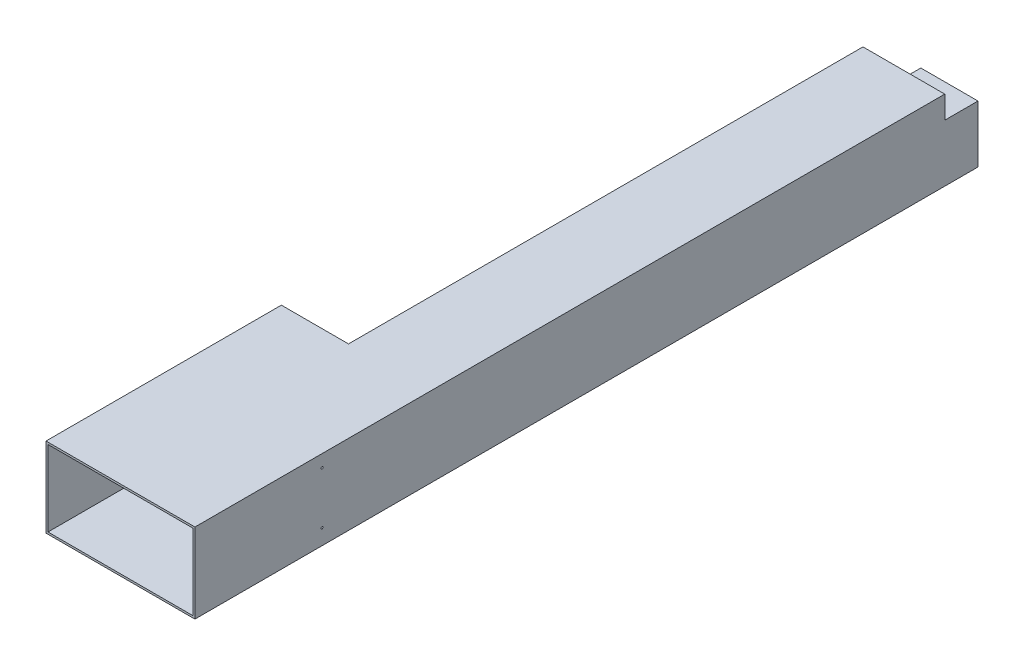
ISO-10303-21;
HEADER;
FILE_DESCRIPTION(('STEP AP214'),'2;1');
FILE_NAME('part.step','',(''),(''),'','','');
FILE_SCHEMA(('AUTOMOTIVE_DESIGN { 1 0 10303 214 1 1 1 1 }'));
ENDSEC;
DATA;
#1=APPLICATION_CONTEXT('core data for automotive mechanical design processes');
#2=APPLICATION_PROTOCOL_DEFINITION('international standard','automotive_design',2000,#1);
#3=PRODUCT_CONTEXT('',#1,'mechanical');
#4=PRODUCT('Part','Part','',(#3));
#5=PRODUCT_RELATED_PRODUCT_CATEGORY('part','',(#4));
#6=PRODUCT_DEFINITION_FORMATION('','',#4);
#7=PRODUCT_DEFINITION_CONTEXT('part definition',#1,'design');
#8=PRODUCT_DEFINITION('design','',#6,#7);
#9=PRODUCT_DEFINITION_SHAPE('','',#8);
#10=(LENGTH_UNIT() NAMED_UNIT(*) SI_UNIT(.MILLI.,.METRE.));
#11=(NAMED_UNIT(*) PLANE_ANGLE_UNIT() SI_UNIT($,.RADIAN.));
#12=(NAMED_UNIT(*) SI_UNIT($,.STERADIAN.) SOLID_ANGLE_UNIT());
#13=UNCERTAINTY_MEASURE_WITH_UNIT(LENGTH_MEASURE(1.E-05),#10,'distance_accuracy_value','');
#14=(GEOMETRIC_REPRESENTATION_CONTEXT(3) GLOBAL_UNCERTAINTY_ASSIGNED_CONTEXT((#13)) GLOBAL_UNIT_ASSIGNED_CONTEXT((#10,
#11,#12)) REPRESENTATION_CONTEXT('',''));
#15=CARTESIAN_POINT('',(0.,0.,0.));
#16=DIRECTION('',(0.,0.,1.));
#17=DIRECTION('',(1.,0.,0.));
#18=AXIS2_PLACEMENT_3D('',#15,#16,#17);
#19=CARTESIAN_POINT('',(0.,5700.,-30555.9041394149));
#20=DIRECTION('',(-1.,0.,0.));
#21=DIRECTION('',(0.,0.,1.));
#22=AXIS2_PLACEMENT_3D('',#19,#20,#21);
#23=PLANE('',#22);
#24=DIRECTION('',(0.,-1.,0.));
#25=VECTOR('',#24,1.);
#26=CARTESIAN_POINT('',(0.,5700.00000000001,-17550.));
#27=LINE('',#26,#25);
#28=CARTESIAN_POINT('',(0.,5700.00000000001,-17550.));
#29=VERTEX_POINT('',#28);
#30=CARTESIAN_POINT('',(0.,7.105427357601E-12,-17550.));
#31=VERTEX_POINT('',#30);
#32=EDGE_CURVE('E11',#29,#31,#27,.T.);
#33=ORIENTED_EDGE('',*,*,#32,.F.);
#34=DIRECTION('',(0.,0.,1.));
#35=VECTOR('',#34,1.);
#36=CARTESIAN_POINT('',(0.,5700.,-30555.9041394149));
#37=LINE('',#36,#35);
#38=CARTESIAN_POINT('',(0.,5700.,0.));
#39=VERTEX_POINT('',#38);
#40=EDGE_CURVE('E181',#29,#39,#37,.T.);
#41=ORIENTED_EDGE('',*,*,#40,.T.);
#42=DIRECTION('',(0.,-1.,0.));
#43=VECTOR('',#42,1.);
#44=CARTESIAN_POINT('',(0.,5700.,0.));
#45=LINE('',#44,#43);
#46=CARTESIAN_POINT('',(0.,0.,0.));
#47=VERTEX_POINT('',#46);
#48=EDGE_CURVE('E278',#39,#47,#45,.T.);
#49=ORIENTED_EDGE('',*,*,#48,.T.);
#50=DIRECTION('',(0.,0.,1.));
#51=VECTOR('',#50,1.);
#52=CARTESIAN_POINT('',(0.,0.,-30555.9041394149));
#53=LINE('',#52,#51);
#54=EDGE_CURVE('E282',#31,#47,#53,.T.);
#55=ORIENTED_EDGE('',*,*,#54,.F.);
#56=EDGE_LOOP('',(#33,#41,#49,#55));
#57=FACE_BOUND('',#56,.T.);
#58=ADVANCED_FACE('F30',(#57),#23,.F.);
#59=CARTESIAN_POINT('',(0.,5700.00000000001,-17700.));
#60=DIRECTION('',(0.,0.,-1.));
#61=DIRECTION('',(-1.,0.,0.));
#62=AXIS2_PLACEMENT_3D('',#59,#60,#61);
#63=PLANE('',#62);
#64=DIRECTION('',(-1.,0.,0.));
#65=VECTOR('',#64,1.);
#66=CARTESIAN_POINT('',(11050.,5850.,-17700.));
#67=LINE('',#66,#65);
#68=CARTESIAN_POINT('',(4900.,5850.,-17700.));
#69=VERTEX_POINT('',#68);
#70=CARTESIAN_POINT('',(-150.000000000002,5850.,-17700.));
#71=VERTEX_POINT('',#70);
#72=EDGE_CURVE('E241',#69,#71,#67,.T.);
#73=ORIENTED_EDGE('',*,*,#72,.F.);
#74=DIRECTION('',(0.,-1.,0.));
#75=VECTOR('',#74,1.);
#76=CARTESIAN_POINT('',(4900.,-150.000000000002,-17700.));
#77=LINE('',#76,#75);
#78=CARTESIAN_POINT('',(4900.,-150.000000000002,-17700.));
#79=VERTEX_POINT('',#78);
#80=EDGE_CURVE('E38',#69,#79,#77,.T.);
#81=ORIENTED_EDGE('',*,*,#80,.T.);
#82=DIRECTION('',(1.,0.,0.));
#83=VECTOR('',#82,1.);
#84=CARTESIAN_POINT('',(-149.999999999999,-149.999999999995,-17700.));
#85=LINE('',#84,#83);
#86=CARTESIAN_POINT('',(-149.999999999999,-149.999999999995,-17700.));
#87=VERTEX_POINT('',#86);
#88=EDGE_CURVE('E297',#87,#79,#85,.T.);
#89=ORIENTED_EDGE('',*,*,#88,.F.);
#90=DIRECTION('',(0.,-1.,0.));
#91=VECTOR('',#90,1.);
#92=CARTESIAN_POINT('',(-150.000000000002,5850.,-17700.));
#93=LINE('',#92,#91);
#94=EDGE_CURVE('E295',#71,#87,#93,.T.);
#95=ORIENTED_EDGE('',*,*,#94,.F.);
#96=EDGE_LOOP('',(#73,#81,#89,#95));
#97=FACE_BOUND('',#96,.T.);
#98=ADVANCED_FACE('F32',(#97),#63,.T.);
#99=CARTESIAN_POINT('',(11050.,-149.999999999999,-30555.9041394149));
#100=DIRECTION('',(1.,0.,0.));
#101=DIRECTION('',(0.,0.,-1.));
#102=AXIS2_PLACEMENT_3D('',#99,#100,#101);
#103=PLANE('',#102);
#104=CARTESIAN_POINT('',(11050.,1020.,-9560.));
#105=DIRECTION('',(1.,0.,0.));
#106=DIRECTION('',(0.,0.,-1.));
#107=AXIS2_PLACEMENT_3D('',#104,#105,#106);
#108=CIRCLE('',#107,74.9999999999987);
#109=CARTESIAN_POINT('',(11050.,1020.,-9635.));
#110=VERTEX_POINT('',#109);
#111=EDGE_CURVE('E436',#110,#110,#108,.T.);
#112=ORIENTED_EDGE('',*,*,#111,.F.);
#113=EDGE_LOOP('',(#112));
#114=FACE_BOUND('',#113,.T.);
#115=CARTESIAN_POINT('',(11050.,4920.,-9560.));
#116=DIRECTION('',(1.,0.,0.));
#117=DIRECTION('',(0.,0.,-1.));
#118=AXIS2_PLACEMENT_3D('',#115,#116,#117);
#119=CIRCLE('',#118,74.9999999999987);
#120=CARTESIAN_POINT('',(11050.,4920.,-9635.));
#121=VERTEX_POINT('',#120);
#122=EDGE_CURVE('E444',#121,#121,#119,.T.);
#123=ORIENTED_EDGE('',*,*,#122,.F.);
#124=EDGE_LOOP('',(#123));
#125=FACE_BOUND('',#124,.T.);
#126=DIRECTION('',(0.,0.,1.));
#127=VECTOR('',#126,1.);
#128=CARTESIAN_POINT('',(11050.,-149.999999999999,-30555.9041394149));
#129=LINE('',#128,#127);
#130=CARTESIAN_POINT('',(11050.,-149.999999999995,-58890.));
#131=VERTEX_POINT('',#130);
#132=CARTESIAN_POINT('',(11050.,-149.999999999999,0.));
#133=VERTEX_POINT('',#132);
#134=EDGE_CURVE('E300',#131,#133,#129,.T.);
#135=ORIENTED_EDGE('',*,*,#134,.F.);
#136=DIRECTION('',(0.,-1.,0.));
#137=VECTOR('',#136,1.);
#138=CARTESIAN_POINT('',(11050.,4150.00000000001,-58890.));
#139=LINE('',#138,#137);
#140=CARTESIAN_POINT('',(11050.,4150.00000000001,-58890.));
#141=VERTEX_POINT('',#140);
#142=EDGE_CURVE('E203',#141,#131,#139,.T.);
#143=ORIENTED_EDGE('',*,*,#142,.F.);
#144=DIRECTION('',(0.,0.,-1.));
#145=VECTOR('',#144,1.);
#146=CARTESIAN_POINT('',(11050.,4150.,-50158.8816817957));
#147=LINE('',#146,#145);
#148=CARTESIAN_POINT('',(11050.,4150.,-56390.));
#149=VERTEX_POINT('',#148);
#150=EDGE_CURVE('E231',#149,#141,#147,.T.);
#151=ORIENTED_EDGE('',*,*,#150,.F.);
#152=DIRECTION('',(0.,-1.,0.));
#153=VECTOR('',#152,1.);
#154=CARTESIAN_POINT('',(11050.,5850.,-56390.));
#155=LINE('',#154,#153);
#156=CARTESIAN_POINT('',(11050.,5850.,-56390.));
#157=VERTEX_POINT('',#156);
#158=EDGE_CURVE('E185',#157,#149,#155,.T.);
#159=ORIENTED_EDGE('',*,*,#158,.F.);
#160=DIRECTION('',(0.,0.,1.));
#161=VECTOR('',#160,1.);
#162=CARTESIAN_POINT('',(11050.,5850.,-30555.9041394149));
#163=LINE('',#162,#161);
#164=CARTESIAN_POINT('',(11050.,5850.,0.));
#165=VERTEX_POINT('',#164);
#166=EDGE_CURVE('E254',#157,#165,#163,.T.);
#167=ORIENTED_EDGE('',*,*,#166,.T.);
#168=DIRECTION('',(0.,1.,0.));
#169=VECTOR('',#168,1.);
#170=CARTESIAN_POINT('',(11050.,-149.999999999999,0.));
#171=LINE('',#170,#169);
#172=EDGE_CURVE('E275',#133,#165,#171,.T.);
#173=ORIENTED_EDGE('',*,*,#172,.F.);
#174=EDGE_LOOP('',(#135,#143,#151,#159,#167,#173));
#175=FACE_BOUND('',#174,.T.);
#176=ADVANCED_FACE('F347',(#114,#125,#175),#103,.T.);
#177=CARTESIAN_POINT('',(-149.999999999999,-149.999999999999,-30555.9041394149));
#178=DIRECTION('',(0.,-1.,0.));
#179=DIRECTION('',(0.,0.,-1.));
#180=AXIS2_PLACEMENT_3D('',#177,#178,#179);
#181=PLANE('',#180);
#182=CARTESIAN_POINT('',(8050.,-149.999999999999,-22960.));
#183=DIRECTION('',(0.,-1.,0.));
#184=DIRECTION('',(0.,0.,-1.));
#185=AXIS2_PLACEMENT_3D('',#182,#183,#184);
#186=CIRCLE('',#185,50.0000000000005);
#187=CARTESIAN_POINT('',(8050.,-149.999999999999,-23010.));
#188=VERTEX_POINT('',#187);
#189=EDGE_CURVE('E431',#188,#188,#186,.T.);
#190=ORIENTED_EDGE('',*,*,#189,.F.);
#191=EDGE_LOOP('',(#190));
#192=FACE_BOUND('',#191,.T.);
#193=DIRECTION('',(1.,0.,0.));
#194=VECTOR('',#193,1.);
#195=CARTESIAN_POINT('',(-149.999999999999,-149.999999999999,0.));
#196=LINE('',#195,#194);
#197=CARTESIAN_POINT('',(-149.999999999999,-149.999999999999,0.));
#198=VERTEX_POINT('',#197);
#199=EDGE_CURVE('E240',#198,#133,#196,.T.);
#200=ORIENTED_EDGE('',*,*,#199,.F.);
#201=DIRECTION('',(0.,0.,1.));
#202=VECTOR('',#201,1.);
#203=CARTESIAN_POINT('',(-149.999999999999,-149.999999999999,-30555.9041394149));
#204=LINE('',#203,#202);
#205=EDGE_CURVE('E308',#87,#198,#204,.T.);
#206=ORIENTED_EDGE('',*,*,#205,.F.);
#207=ORIENTED_EDGE('',*,*,#88,.T.);
#208=DIRECTION('',(0.,0.,-1.));
#209=VECTOR('',#208,1.);
#210=CARTESIAN_POINT('',(4900.,-150.000000000002,-9107.99790502819));
#211=LINE('',#210,#209);
#212=CARTESIAN_POINT('',(4900.,-150.000000000002,-56390.));
#213=VERTEX_POINT('',#212);
#214=EDGE_CURVE('E166',#79,#213,#211,.T.);
#215=ORIENTED_EDGE('',*,*,#214,.T.);
#216=DIRECTION('',(-1.,0.,0.));
#217=VECTOR('',#216,1.);
#218=CARTESIAN_POINT('',(6750.,-150.000000000002,-56390.));
#219=LINE('',#218,#217);
#220=CARTESIAN_POINT('',(6750.,-150.000000000002,-56390.));
#221=VERTEX_POINT('',#220);
#222=EDGE_CURVE('E194',#221,#213,#219,.T.);
#223=ORIENTED_EDGE('',*,*,#222,.F.);
#224=DIRECTION('',(0.,0.,-1.));
#225=VECTOR('',#224,1.);
#226=CARTESIAN_POINT('',(6750.,-149.999999999995,-50158.8816817957));
#227=LINE('',#226,#225);
#228=CARTESIAN_POINT('',(6750.,-149.999999999995,-58890.));
#229=VERTEX_POINT('',#228);
#230=EDGE_CURVE('E45',#221,#229,#227,.T.);
#231=ORIENTED_EDGE('',*,*,#230,.T.);
#232=DIRECTION('',(-1.,0.,0.));
#233=VECTOR('',#232,1.);
#234=CARTESIAN_POINT('',(11050.,-149.999999999995,-58890.));
#235=LINE('',#234,#233);
#236=EDGE_CURVE('E206',#131,#229,#235,.T.);
#237=ORIENTED_EDGE('',*,*,#236,.F.);
#238=ORIENTED_EDGE('',*,*,#134,.T.);
#239=EDGE_LOOP('',(#200,#206,#207,#215,#223,#231,#237,#238));
#240=FACE_BOUND('',#239,.T.);
#241=ADVANCED_FACE('F322',(#192,#240),#181,.T.);
#242=CARTESIAN_POINT('',(-150.000000000002,5850.,-30555.9041394149));
#243=DIRECTION('',(-1.,0.,0.));
#244=DIRECTION('',(0.,0.,1.));
#245=AXIS2_PLACEMENT_3D('',#242,#243,#244);
#246=PLANE('',#245);
#247=ORIENTED_EDGE('',*,*,#205,.T.);
#248=DIRECTION('',(0.,-1.,0.));
#249=VECTOR('',#248,1.);
#250=CARTESIAN_POINT('',(-150.000000000002,5850.,0.));
#251=LINE('',#250,#249);
#252=CARTESIAN_POINT('',(-150.000000000002,5850.,0.));
#253=VERTEX_POINT('',#252);
#254=EDGE_CURVE('E269',#253,#198,#251,.T.);
#255=ORIENTED_EDGE('',*,*,#254,.F.);
#256=DIRECTION('',(0.,0.,1.));
#257=VECTOR('',#256,1.);
#258=CARTESIAN_POINT('',(-150.000000000002,5850.,-30555.9041394149));
#259=LINE('',#258,#257);
#260=EDGE_CURVE('E305',#71,#253,#259,.T.);
#261=ORIENTED_EDGE('',*,*,#260,.F.);
#262=ORIENTED_EDGE('',*,*,#94,.T.);
#263=EDGE_LOOP('',(#247,#255,#261,#262));
#264=FACE_BOUND('',#263,.T.);
#265=ADVANCED_FACE('F317',(#264),#246,.T.);
#266=CARTESIAN_POINT('',(11050.,5850.,-30555.9041394149));
#267=DIRECTION('',(0.,1.,0.));
#268=DIRECTION('',(0.,0.,1.));
#269=AXIS2_PLACEMENT_3D('',#266,#267,#268);
#270=PLANE('',#269);
#271=ORIENTED_EDGE('',*,*,#260,.T.);
#272=DIRECTION('',(-1.,0.,0.));
#273=VECTOR('',#272,1.);
#274=CARTESIAN_POINT('',(11050.,5850.,0.));
#275=LINE('',#274,#273);
#276=EDGE_CURVE('E272',#165,#253,#275,.T.);
#277=ORIENTED_EDGE('',*,*,#276,.F.);
#278=ORIENTED_EDGE('',*,*,#166,.F.);
#279=DIRECTION('',(1.,0.,0.));
#280=VECTOR('',#279,1.);
#281=CARTESIAN_POINT('',(4900.,5850.,-56390.));
#282=LINE('',#281,#280);
#283=CARTESIAN_POINT('',(4900.,5850.,-56390.));
#284=VERTEX_POINT('',#283);
#285=EDGE_CURVE('E182',#284,#157,#282,.T.);
#286=ORIENTED_EDGE('',*,*,#285,.F.);
#287=DIRECTION('',(0.,0.,-1.));
#288=VECTOR('',#287,1.);
#289=CARTESIAN_POINT('',(4900.,5850.,-9107.99790502819));
#290=LINE('',#289,#288);
#291=EDGE_CURVE('E245',#69,#284,#290,.T.);
#292=ORIENTED_EDGE('',*,*,#291,.F.);
#293=ORIENTED_EDGE('',*,*,#72,.T.);
#294=EDGE_LOOP('',(#271,#277,#278,#286,#292,#293));
#295=FACE_BOUND('',#294,.T.);
#296=ADVANCED_FACE('F327',(#295),#270,.T.);
#297=CARTESIAN_POINT('',(10900.,5700.,-30555.9041394149));
#298=DIRECTION('',(0.,1.,0.));
#299=DIRECTION('',(-1.,0.,0.));
#300=AXIS2_PLACEMENT_3D('',#297,#298,#299);
#301=PLANE('',#300);
#302=DIRECTION('',(-1.,0.,0.));
#303=VECTOR('',#302,1.);
#304=CARTESIAN_POINT('',(10900.,5700.,-17550.));
#305=LINE('',#304,#303);
#306=CARTESIAN_POINT('',(5050.,5700.,-17550.));
#307=VERTEX_POINT('',#306);
#308=EDGE_CURVE('E172',#307,#29,#305,.T.);
#309=ORIENTED_EDGE('',*,*,#308,.F.);
#310=DIRECTION('',(0.,0.,-1.));
#311=VECTOR('',#310,1.);
#312=CARTESIAN_POINT('',(5050.,5700.,-9107.99790502819));
#313=LINE('',#312,#311);
#314=CARTESIAN_POINT('',(5050.,5700.,-56240.));
#315=VERTEX_POINT('',#314);
#316=EDGE_CURVE('E156',#307,#315,#313,.T.);
#317=ORIENTED_EDGE('',*,*,#316,.T.);
#318=DIRECTION('',(1.,0.,0.));
#319=VECTOR('',#318,1.);
#320=CARTESIAN_POINT('',(5050.,5700.,-56240.));
#321=LINE('',#320,#319);
#322=CARTESIAN_POINT('',(10900.,5700.,-56240.));
#323=VERTEX_POINT('',#322);
#324=EDGE_CURVE('E234',#315,#323,#321,.T.);
#325=ORIENTED_EDGE('',*,*,#324,.T.);
#326=DIRECTION('',(0.,0.,1.));
#327=VECTOR('',#326,1.);
#328=CARTESIAN_POINT('',(10900.,5700.,-30555.9041394149));
#329=LINE('',#328,#327);
#330=CARTESIAN_POINT('',(10900.,5700.,0.));
#331=VERTEX_POINT('',#330);
#332=EDGE_CURVE('E290',#323,#331,#329,.T.);
#333=ORIENTED_EDGE('',*,*,#332,.T.);
#334=DIRECTION('',(-1.,0.,0.));
#335=VECTOR('',#334,1.);
#336=CARTESIAN_POINT('',(10900.,5700.,0.));
#337=LINE('',#336,#335);
#338=EDGE_CURVE('E289',#331,#39,#337,.T.);
#339=ORIENTED_EDGE('',*,*,#338,.T.);
#340=ORIENTED_EDGE('',*,*,#40,.F.);
#341=EDGE_LOOP('',(#309,#317,#325,#333,#339,#340));
#342=FACE_BOUND('',#341,.T.);
#343=ADVANCED_FACE('F179',(#342),#301,.F.);
#344=CARTESIAN_POINT('',(10900.,0.,-30555.9041394149));
#345=DIRECTION('',(1.,0.,0.));
#346=DIRECTION('',(0.,0.,-1.));
#347=AXIS2_PLACEMENT_3D('',#344,#345,#346);
#348=PLANE('',#347);
#349=CARTESIAN_POINT('',(10900.,1020.,-9560.));
#350=DIRECTION('',(1.,0.,0.));
#351=DIRECTION('',(0.,0.,-1.));
#352=AXIS2_PLACEMENT_3D('',#349,#350,#351);
#353=CIRCLE('',#352,74.9999999999987);
#354=CARTESIAN_POINT('',(10900.,1020.,-9635.));
#355=VERTEX_POINT('',#354);
#356=EDGE_CURVE('E441',#355,#355,#353,.F.);
#357=ORIENTED_EDGE('',*,*,#356,.F.);
#358=EDGE_LOOP('',(#357));
#359=FACE_BOUND('',#358,.T.);
#360=CARTESIAN_POINT('',(10900.,4920.,-9560.));
#361=DIRECTION('',(1.,0.,0.));
#362=DIRECTION('',(0.,0.,-1.));
#363=AXIS2_PLACEMENT_3D('',#360,#361,#362);
#364=CIRCLE('',#363,74.9999999999987);
#365=CARTESIAN_POINT('',(10900.,4920.,-9635.));
#366=VERTEX_POINT('',#365);
#367=EDGE_CURVE('E176',#366,#366,#364,.F.);
#368=ORIENTED_EDGE('',*,*,#367,.F.);
#369=EDGE_LOOP('',(#368));
#370=FACE_BOUND('',#369,.T.);
#371=ORIENTED_EDGE('',*,*,#332,.F.);
#372=DIRECTION('',(0.,-1.,0.));
#373=VECTOR('',#372,1.);
#374=CARTESIAN_POINT('',(10900.,5700.,-56240.));
#375=LINE('',#374,#373);
#376=CARTESIAN_POINT('',(10900.,4000.,-56240.));
#377=VERTEX_POINT('',#376);
#378=EDGE_CURVE('E260',#323,#377,#375,.T.);
#379=ORIENTED_EDGE('',*,*,#378,.T.);
#380=DIRECTION('',(0.,0.,-1.));
#381=VECTOR('',#380,1.);
#382=CARTESIAN_POINT('',(10900.,4000.,-50158.8816817957));
#383=LINE('',#382,#381);
#384=CARTESIAN_POINT('',(10900.,4000.00000000001,-58740.));
#385=VERTEX_POINT('',#384);
#386=EDGE_CURVE('E224',#377,#385,#383,.T.);
#387=ORIENTED_EDGE('',*,*,#386,.T.);
#388=DIRECTION('',(0.,-1.,0.));
#389=VECTOR('',#388,1.);
#390=CARTESIAN_POINT('',(10900.,4000.00000000001,-58740.));
#391=LINE('',#390,#389);
#392=CARTESIAN_POINT('',(10900.,3.5527136788005E-12,-58740.));
#393=VERTEX_POINT('',#392);
#394=EDGE_CURVE('E215',#385,#393,#391,.T.);
#395=ORIENTED_EDGE('',*,*,#394,.T.);
#396=DIRECTION('',(0.,0.,1.));
#397=VECTOR('',#396,1.);
#398=CARTESIAN_POINT('',(10900.,0.,-30555.9041394149));
#399=LINE('',#398,#397);
#400=CARTESIAN_POINT('',(10900.,0.,0.));
#401=VERTEX_POINT('',#400);
#402=EDGE_CURVE('E283',#393,#401,#399,.T.);
#403=ORIENTED_EDGE('',*,*,#402,.T.);
#404=DIRECTION('',(0.,1.,0.));
#405=VECTOR('',#404,1.);
#406=CARTESIAN_POINT('',(10900.,0.,0.));
#407=LINE('',#406,#405);
#408=EDGE_CURVE('E279',#401,#331,#407,.T.);
#409=ORIENTED_EDGE('',*,*,#408,.T.);
#410=EDGE_LOOP('',(#371,#379,#387,#395,#403,#409));
#411=FACE_BOUND('',#410,.T.);
#412=ADVANCED_FACE('F368',(#359,#370,#411),#348,.F.);
#413=CARTESIAN_POINT('',(0.,0.,-30555.9041394149));
#414=DIRECTION('',(0.,-1.,0.));
#415=DIRECTION('',(1.,0.,0.));
#416=AXIS2_PLACEMENT_3D('',#413,#414,#415);
#417=PLANE('',#416);
#418=CARTESIAN_POINT('',(8050.,0.,-22960.));
#419=DIRECTION('',(0.,-1.,0.));
#420=DIRECTION('',(1.,0.,0.));
#421=AXIS2_PLACEMENT_3D('',#418,#419,#420);
#422=CIRCLE('',#421,50.0000000000005);
#423=CARTESIAN_POINT('',(8100.,0.,-22960.));
#424=VERTEX_POINT('',#423);
#425=EDGE_CURVE('E434',#424,#424,#422,.F.);
#426=ORIENTED_EDGE('',*,*,#425,.F.);
#427=EDGE_LOOP('',(#426));
#428=FACE_BOUND('',#427,.T.);
#429=DIRECTION('',(0.,0.,-1.));
#430=VECTOR('',#429,1.);
#431=CARTESIAN_POINT('',(5050.,0.,-9107.99790502819));
#432=LINE('',#431,#430);
#433=CARTESIAN_POINT('',(5050.,0.,-17550.));
#434=VERTEX_POINT('',#433);
#435=CARTESIAN_POINT('',(5050.,-3.5527136788005E-12,-56240.));
#436=VERTEX_POINT('',#435);
#437=EDGE_CURVE('E167',#434,#436,#432,.T.);
#438=ORIENTED_EDGE('',*,*,#437,.F.);
#439=DIRECTION('',(1.,0.,0.));
#440=VECTOR('',#439,1.);
#441=CARTESIAN_POINT('',(0.,7.105427357601E-12,-17550.));
#442=LINE('',#441,#440);
#443=EDGE_CURVE('E175',#31,#434,#442,.T.);
#444=ORIENTED_EDGE('',*,*,#443,.F.);
#445=ORIENTED_EDGE('',*,*,#54,.T.);
#446=DIRECTION('',(1.,0.,0.));
#447=VECTOR('',#446,1.);
#448=CARTESIAN_POINT('',(0.,0.,0.));
#449=LINE('',#448,#447);
#450=EDGE_CURVE('E284',#47,#401,#449,.T.);
#451=ORIENTED_EDGE('',*,*,#450,.T.);
#452=ORIENTED_EDGE('',*,*,#402,.F.);
#453=DIRECTION('',(-1.,0.,0.));
#454=VECTOR('',#453,1.);
#455=CARTESIAN_POINT('',(10900.,3.5527136788005E-12,-58740.));
#456=LINE('',#455,#454);
#457=CARTESIAN_POINT('',(6900.,3.5527136788005E-12,-58740.));
#458=VERTEX_POINT('',#457);
#459=EDGE_CURVE('E218',#393,#458,#456,.T.);
#460=ORIENTED_EDGE('',*,*,#459,.T.);
#461=DIRECTION('',(0.,0.,-1.));
#462=VECTOR('',#461,1.);
#463=CARTESIAN_POINT('',(6900.,7.105427357601E-12,-50158.8816817957));
#464=LINE('',#463,#462);
#465=CARTESIAN_POINT('',(6900.,0.,-56240.));
#466=VERTEX_POINT('',#465);
#467=EDGE_CURVE('E228',#466,#458,#464,.T.);
#468=ORIENTED_EDGE('',*,*,#467,.F.);
#469=DIRECTION('',(-1.,0.,0.));
#470=VECTOR('',#469,1.);
#471=CARTESIAN_POINT('',(10900.,0.,-56240.));
#472=LINE('',#471,#470);
#473=EDGE_CURVE('E257',#466,#436,#472,.T.);
#474=ORIENTED_EDGE('',*,*,#473,.T.);
#475=EDGE_LOOP('',(#438,#444,#445,#451,#452,#460,#468,#474));
#476=FACE_BOUND('',#475,.T.);
#477=ADVANCED_FACE('F365',(#428,#476),#417,.F.);
#478=CARTESIAN_POINT('',(11050.,5850.,0.));
#479=DIRECTION('',(0.,0.,1.));
#480=DIRECTION('',(1.,0.,0.));
#481=AXIS2_PLACEMENT_3D('',#478,#479,#480);
#482=PLANE('',#481);
#483=ORIENTED_EDGE('',*,*,#338,.F.);
#484=ORIENTED_EDGE('',*,*,#408,.F.);
#485=ORIENTED_EDGE('',*,*,#450,.F.);
#486=ORIENTED_EDGE('',*,*,#48,.F.);
#487=EDGE_LOOP('',(#483,#484,#485,#486));
#488=FACE_BOUND('',#487,.T.);
#489=ORIENTED_EDGE('',*,*,#172,.T.);
#490=ORIENTED_EDGE('',*,*,#276,.T.);
#491=ORIENTED_EDGE('',*,*,#254,.T.);
#492=ORIENTED_EDGE('',*,*,#199,.T.);
#493=EDGE_LOOP('',(#489,#490,#491,#492));
#494=FACE_BOUND('',#493,.T.);
#495=ADVANCED_FACE('F324',(#488,#494),#482,.T.);
#496=CARTESIAN_POINT('',(4900.,-150.000000000002,-9107.99790502819));
#497=DIRECTION('',(-1.,0.,0.));
#498=DIRECTION('',(0.,0.,1.));
#499=AXIS2_PLACEMENT_3D('',#496,#497,#498);
#500=PLANE('',#499);
#501=ORIENTED_EDGE('',*,*,#80,.F.);
#502=ORIENTED_EDGE('',*,*,#291,.T.);
#503=DIRECTION('',(0.,1.,0.));
#504=VECTOR('',#503,1.);
#505=CARTESIAN_POINT('',(4900.,-150.000000000002,-56390.));
#506=LINE('',#505,#504);
#507=EDGE_CURVE('E197',#213,#284,#506,.T.);
#508=ORIENTED_EDGE('',*,*,#507,.F.);
#509=ORIENTED_EDGE('',*,*,#214,.F.);
#510=EDGE_LOOP('',(#501,#502,#508,#509));
#511=FACE_BOUND('',#510,.T.);
#512=ADVANCED_FACE('F333',(#511),#500,.T.);
#513=CARTESIAN_POINT('',(5050.,0.,-9107.99790502819));
#514=DIRECTION('',(-1.,0.,0.));
#515=DIRECTION('',(0.,-1.,0.));
#516=AXIS2_PLACEMENT_3D('',#513,#514,#515);
#517=PLANE('',#516);
#518=ORIENTED_EDGE('',*,*,#316,.F.);
#519=DIRECTION('',(0.,-1.,0.));
#520=VECTOR('',#519,1.);
#521=CARTESIAN_POINT('',(5050.,5850.,-17550.));
#522=LINE('',#521,#520);
#523=EDGE_CURVE('E160',#307,#434,#522,.T.);
#524=ORIENTED_EDGE('',*,*,#523,.T.);
#525=ORIENTED_EDGE('',*,*,#437,.T.);
#526=DIRECTION('',(0.,1.,0.));
#527=VECTOR('',#526,1.);
#528=CARTESIAN_POINT('',(5050.,-3.5527136788005E-12,-56240.));
#529=LINE('',#528,#527);
#530=EDGE_CURVE('E162',#436,#315,#529,.T.);
#531=ORIENTED_EDGE('',*,*,#530,.T.);
#532=EDGE_LOOP('',(#518,#524,#525,#531));
#533=FACE_BOUND('',#532,.T.);
#534=ADVANCED_FACE('F158',(#533),#517,.F.);
#535=CARTESIAN_POINT('',(6750.,-149.999999999995,-50158.8816817957));
#536=DIRECTION('',(-1.,0.,0.));
#537=DIRECTION('',(0.,0.,1.));
#538=AXIS2_PLACEMENT_3D('',#535,#536,#537);
#539=PLANE('',#538);
#540=DIRECTION('',(0.,-1.,0.));
#541=VECTOR('',#540,1.);
#542=CARTESIAN_POINT('',(6750.,4150.,-56390.));
#543=LINE('',#542,#541);
#544=CARTESIAN_POINT('',(6750.,4150.,-56390.));
#545=VERTEX_POINT('',#544);
#546=EDGE_CURVE('E192',#545,#221,#543,.T.);
#547=ORIENTED_EDGE('',*,*,#546,.F.);
#548=DIRECTION('',(0.,0.,-1.));
#549=VECTOR('',#548,1.);
#550=CARTESIAN_POINT('',(6750.,4150.00000000001,-50158.8816817957));
#551=LINE('',#550,#549);
#552=CARTESIAN_POINT('',(6750.,4150.00000000001,-58890.));
#553=VERTEX_POINT('',#552);
#554=EDGE_CURVE('E229',#545,#553,#551,.T.);
#555=ORIENTED_EDGE('',*,*,#554,.T.);
#556=DIRECTION('',(0.,1.,0.));
#557=VECTOR('',#556,1.);
#558=CARTESIAN_POINT('',(6750.,-149.999999999995,-58890.));
#559=LINE('',#558,#557);
#560=EDGE_CURVE('E209',#229,#553,#559,.T.);
#561=ORIENTED_EDGE('',*,*,#560,.F.);
#562=ORIENTED_EDGE('',*,*,#230,.F.);
#563=EDGE_LOOP('',(#547,#555,#561,#562));
#564=FACE_BOUND('',#563,.T.);
#565=ADVANCED_FACE('F342',(#564),#539,.T.);
#566=CARTESIAN_POINT('',(6750.,4150.00000000001,-50158.8816817957));
#567=DIRECTION('',(0.,1.,0.));
#568=DIRECTION('',(0.,0.,1.));
#569=AXIS2_PLACEMENT_3D('',#566,#567,#568);
#570=PLANE('',#569);
#571=DIRECTION('',(-1.,0.,0.));
#572=VECTOR('',#571,1.);
#573=CARTESIAN_POINT('',(11050.,4150.,-56390.));
#574=LINE('',#573,#572);
#575=EDGE_CURVE('E53',#149,#545,#574,.T.);
#576=ORIENTED_EDGE('',*,*,#575,.F.);
#577=ORIENTED_EDGE('',*,*,#150,.T.);
#578=DIRECTION('',(1.,0.,0.));
#579=VECTOR('',#578,1.);
#580=CARTESIAN_POINT('',(6750.,4150.00000000001,-58890.));
#581=LINE('',#580,#579);
#582=EDGE_CURVE('E200',#553,#141,#581,.T.);
#583=ORIENTED_EDGE('',*,*,#582,.F.);
#584=ORIENTED_EDGE('',*,*,#554,.F.);
#585=EDGE_LOOP('',(#576,#577,#583,#584));
#586=FACE_BOUND('',#585,.T.);
#587=ADVANCED_FACE('F343',(#586),#570,.T.);
#588=CARTESIAN_POINT('',(6900.,7.105427357601E-12,-50158.8816817957));
#589=DIRECTION('',(-1.,0.,0.));
#590=DIRECTION('',(0.,0.,1.));
#591=AXIS2_PLACEMENT_3D('',#588,#589,#590);
#592=PLANE('',#591);
#593=DIRECTION('',(0.,0.,-1.));
#594=VECTOR('',#593,1.);
#595=CARTESIAN_POINT('',(6900.,4000.00000000001,-50158.8816817957));
#596=LINE('',#595,#594);
#597=CARTESIAN_POINT('',(6900.,4000.,-56240.));
#598=VERTEX_POINT('',#597);
#599=CARTESIAN_POINT('',(6900.,4000.,-58740.));
#600=VERTEX_POINT('',#599);
#601=EDGE_CURVE('E225',#598,#600,#596,.T.);
#602=ORIENTED_EDGE('',*,*,#601,.F.);
#603=DIRECTION('',(0.,-1.,0.));
#604=VECTOR('',#603,1.);
#605=CARTESIAN_POINT('',(6900.,0.,-56240.));
#606=LINE('',#605,#604);
#607=EDGE_CURVE('E457',#598,#466,#606,.T.);
#608=ORIENTED_EDGE('',*,*,#607,.T.);
#609=ORIENTED_EDGE('',*,*,#467,.T.);
#610=DIRECTION('',(0.,1.,0.));
#611=VECTOR('',#610,1.);
#612=CARTESIAN_POINT('',(6900.,3.5527136788005E-12,-58740.));
#613=LINE('',#612,#611);
#614=EDGE_CURVE('E221',#458,#600,#613,.T.);
#615=ORIENTED_EDGE('',*,*,#614,.T.);
#616=EDGE_LOOP('',(#602,#608,#609,#615));
#617=FACE_BOUND('',#616,.T.);
#618=ADVANCED_FACE('F393',(#617),#592,.F.);
#619=CARTESIAN_POINT('',(6900.,4000.00000000001,-50158.8816817957));
#620=DIRECTION('',(0.,1.,0.));
#621=DIRECTION('',(0.,0.,1.));
#622=AXIS2_PLACEMENT_3D('',#619,#620,#621);
#623=PLANE('',#622);
#624=ORIENTED_EDGE('',*,*,#386,.F.);
#625=DIRECTION('',(-1.,0.,0.));
#626=VECTOR('',#625,1.);
#627=CARTESIAN_POINT('',(6900.,4000.,-56240.));
#628=LINE('',#627,#626);
#629=EDGE_CURVE('E345',#377,#598,#628,.T.);
#630=ORIENTED_EDGE('',*,*,#629,.T.);
#631=ORIENTED_EDGE('',*,*,#601,.T.);
#632=DIRECTION('',(1.,0.,0.));
#633=VECTOR('',#632,1.);
#634=CARTESIAN_POINT('',(6900.,4000.,-58740.));
#635=LINE('',#634,#633);
#636=EDGE_CURVE('E212',#600,#385,#635,.T.);
#637=ORIENTED_EDGE('',*,*,#636,.T.);
#638=EDGE_LOOP('',(#624,#630,#631,#637));
#639=FACE_BOUND('',#638,.T.);
#640=ADVANCED_FACE('F394',(#639),#623,.F.);
#641=CARTESIAN_POINT('',(11050.,-149.999999999999,-56240.));
#642=DIRECTION('',(0.,0.,-1.));
#643=DIRECTION('',(-1.,0.,0.));
#644=AXIS2_PLACEMENT_3D('',#641,#642,#643);
#645=PLANE('',#644);
#646=ORIENTED_EDGE('',*,*,#473,.F.);
#647=ORIENTED_EDGE('',*,*,#607,.F.);
#648=ORIENTED_EDGE('',*,*,#629,.F.);
#649=ORIENTED_EDGE('',*,*,#378,.F.);
#650=ORIENTED_EDGE('',*,*,#324,.F.);
#651=ORIENTED_EDGE('',*,*,#530,.F.);
#652=EDGE_LOOP('',(#646,#647,#648,#649,#650,#651));
#653=FACE_BOUND('',#652,.T.);
#654=ADVANCED_FACE('F397',(#653),#645,.F.);
#655=CARTESIAN_POINT('',(11050.,4150.00000000001,-58740.));
#656=DIRECTION('',(0.,0.,-1.));
#657=DIRECTION('',(-1.,0.,0.));
#658=AXIS2_PLACEMENT_3D('',#655,#656,#657);
#659=PLANE('',#658);
#660=ORIENTED_EDGE('',*,*,#459,.F.);
#661=ORIENTED_EDGE('',*,*,#394,.F.);
#662=ORIENTED_EDGE('',*,*,#636,.F.);
#663=ORIENTED_EDGE('',*,*,#614,.F.);
#664=EDGE_LOOP('',(#660,#661,#662,#663));
#665=FACE_BOUND('',#664,.T.);
#666=ADVANCED_FACE('F404',(#665),#659,.F.);
#667=CARTESIAN_POINT('',(11050.,4150.00000000001,-58890.));
#668=DIRECTION('',(0.,0.,-1.));
#669=DIRECTION('',(-1.,0.,0.));
#670=AXIS2_PLACEMENT_3D('',#667,#668,#669);
#671=PLANE('',#670);
#672=ORIENTED_EDGE('',*,*,#582,.T.);
#673=ORIENTED_EDGE('',*,*,#142,.T.);
#674=ORIENTED_EDGE('',*,*,#236,.T.);
#675=ORIENTED_EDGE('',*,*,#560,.T.);
#676=EDGE_LOOP('',(#672,#673,#674,#675));
#677=FACE_BOUND('',#676,.T.);
#678=ADVANCED_FACE('F339',(#677),#671,.T.);
#679=CARTESIAN_POINT('',(11050.,5850.,-56390.));
#680=DIRECTION('',(0.,0.,-1.));
#681=DIRECTION('',(-1.,0.,0.));
#682=AXIS2_PLACEMENT_3D('',#679,#680,#681);
#683=PLANE('',#682);
#684=ORIENTED_EDGE('',*,*,#285,.T.);
#685=ORIENTED_EDGE('',*,*,#158,.T.);
#686=ORIENTED_EDGE('',*,*,#575,.T.);
#687=ORIENTED_EDGE('',*,*,#546,.T.);
#688=ORIENTED_EDGE('',*,*,#222,.T.);
#689=ORIENTED_EDGE('',*,*,#507,.T.);
#690=EDGE_LOOP('',(#684,#685,#686,#687,#688,#689));
#691=FACE_BOUND('',#690,.T.);
#692=ADVANCED_FACE('F335',(#691),#683,.T.);
#693=CARTESIAN_POINT('',(-150.000000000002,5850.,-17550.));
#694=DIRECTION('',(0.,0.,-1.));
#695=DIRECTION('',(-1.,0.,0.));
#696=AXIS2_PLACEMENT_3D('',#693,#694,#695);
#697=PLANE('',#696);
#698=ORIENTED_EDGE('',*,*,#523,.F.);
#699=ORIENTED_EDGE('',*,*,#308,.T.);
#700=ORIENTED_EDGE('',*,*,#32,.T.);
#701=ORIENTED_EDGE('',*,*,#443,.T.);
#702=EDGE_LOOP('',(#698,#699,#700,#701));
#703=FACE_BOUND('',#702,.T.);
#704=ADVANCED_FACE('F171',(#703),#697,.F.);
#705=CARTESIAN_POINT('',(-150.001025000002,4920.00000000001,-9560.));
#706=DIRECTION('',(1.,0.,0.));
#707=DIRECTION('',(0.,0.,-1.));
#708=AXIS2_PLACEMENT_3D('',#705,#706,#707);
#709=CYLINDRICAL_SURFACE('',#708,74.9999999999987);
#710=ORIENTED_EDGE('',*,*,#122,.T.);
#711=EDGE_LOOP('',(#710));
#712=FACE_BOUND('',#711,.T.);
#713=ORIENTED_EDGE('',*,*,#367,.T.);
#714=EDGE_LOOP('',(#713));
#715=FACE_BOUND('',#714,.T.);
#716=ADVANCED_FACE('F415',(#712,#715),#709,.F.);
#717=CARTESIAN_POINT('',(-150.001025000002,1020.00000000001,-9560.));
#718=DIRECTION('',(1.,0.,0.));
#719=DIRECTION('',(0.,0.,-1.));
#720=AXIS2_PLACEMENT_3D('',#717,#718,#719);
#721=CYLINDRICAL_SURFACE('',#720,74.9999999999987);
#722=ORIENTED_EDGE('',*,*,#111,.T.);
#723=EDGE_LOOP('',(#722));
#724=FACE_BOUND('',#723,.T.);
#725=ORIENTED_EDGE('',*,*,#356,.T.);
#726=EDGE_LOOP('',(#725));
#727=FACE_BOUND('',#726,.T.);
#728=ADVANCED_FACE('F418',(#724,#727),#721,.F.);
#729=CARTESIAN_POINT('',(8050.,5850.00105,-22960.));
#730=DIRECTION('',(0.,-1.,0.));
#731=DIRECTION('',(0.,0.,-1.));
#732=AXIS2_PLACEMENT_3D('',#729,#730,#731);
#733=CYLINDRICAL_SURFACE('',#732,50.0000000000005);
#734=ORIENTED_EDGE('',*,*,#189,.T.);
#735=EDGE_LOOP('',(#734));
#736=FACE_BOUND('',#735,.T.);
#737=ORIENTED_EDGE('',*,*,#425,.T.);
#738=EDGE_LOOP('',(#737));
#739=FACE_BOUND('',#738,.T.);
#740=ADVANCED_FACE('F422',(#736,#739),#733,.F.);
#741=CLOSED_SHELL('',(#58,#98,#176,#241,#265,#296,#343,#412,#477,#495,#512,#534,#565,#587,#618,
#640,#654,#666,#678,#692,#704,#716,#728,#740));
#742=MANIFOLD_SOLID_BREP('B2',#741);
#743=ADVANCED_BREP_SHAPE_REPRESENTATION('',(#18,#742),#14);
#744=SHAPE_DEFINITION_REPRESENTATION(#9,#743);
ENDSEC;
END-ISO-10303-21;
